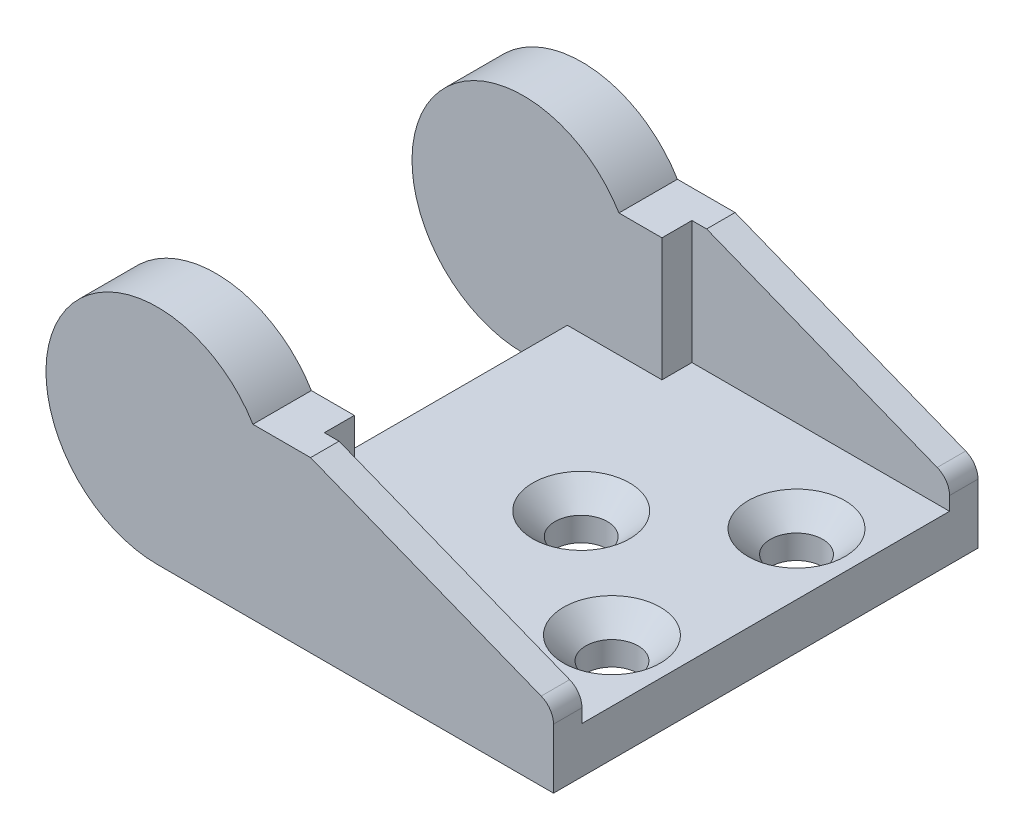
ISO-10303-21;
HEADER;
FILE_DESCRIPTION(('STEP AP214'),'2;1');
FILE_NAME('part.step','',(''),(''),'','','');
FILE_SCHEMA(('AUTOMOTIVE_DESIGN { 1 0 10303 214 1 1 1 1 }'));
ENDSEC;
DATA;
#1=APPLICATION_CONTEXT('core data for automotive mechanical design processes');
#2=APPLICATION_PROTOCOL_DEFINITION('international standard','automotive_design',2000,#1);
#3=PRODUCT_CONTEXT('',#1,'mechanical');
#4=PRODUCT('Part','Part','',(#3));
#5=PRODUCT_RELATED_PRODUCT_CATEGORY('part','',(#4));
#6=PRODUCT_DEFINITION_FORMATION('','',#4);
#7=PRODUCT_DEFINITION_CONTEXT('part definition',#1,'design');
#8=PRODUCT_DEFINITION('design','',#6,#7);
#9=PRODUCT_DEFINITION_SHAPE('','',#8);
#10=(LENGTH_UNIT() NAMED_UNIT(*) SI_UNIT(.MILLI.,.METRE.));
#11=(NAMED_UNIT(*) PLANE_ANGLE_UNIT() SI_UNIT($,.RADIAN.));
#12=(NAMED_UNIT(*) SI_UNIT($,.STERADIAN.) SOLID_ANGLE_UNIT());
#13=UNCERTAINTY_MEASURE_WITH_UNIT(LENGTH_MEASURE(1.E-05),#10,'distance_accuracy_value','');
#14=(GEOMETRIC_REPRESENTATION_CONTEXT(3) GLOBAL_UNCERTAINTY_ASSIGNED_CONTEXT((#13)) GLOBAL_UNIT_ASSIGNED_CONTEXT((#10,
#11,#12)) REPRESENTATION_CONTEXT('',''));
#15=CARTESIAN_POINT('',(0.,0.,0.));
#16=DIRECTION('',(0.,0.,1.));
#17=DIRECTION('',(1.,0.,0.));
#18=AXIS2_PLACEMENT_3D('',#15,#16,#17);
#19=CARTESIAN_POINT('',(0.,0.,13.8));
#20=DIRECTION('',(0.,0.,-1.));
#21=DIRECTION('',(-1.,0.,0.));
#22=AXIS2_PLACEMENT_3D('',#19,#20,#21);
#23=CYLINDRICAL_SURFACE('',#22,7.25);
#24=DIRECTION('',(0.,0.,-1.));
#25=VECTOR('',#24,1.);
#26=CARTESIAN_POINT('',(6.20483682299543,3.75,13.8));
#27=LINE('',#26,#25);
#28=CARTESIAN_POINT('',(6.20483682299543,3.75,13.8));
#29=VERTEX_POINT('',#28);
#30=CARTESIAN_POINT('',(6.20483682299543,3.75,10.));
#31=VERTEX_POINT('',#30);
#32=EDGE_CURVE('E236',#29,#31,#27,.T.);
#33=ORIENTED_EDGE('',*,*,#32,.T.);
#34=CARTESIAN_POINT('',(0.,0.,10.));
#35=DIRECTION('',(0.,0.,1.));
#36=DIRECTION('',(1.,0.,0.));
#37=AXIS2_PLACEMENT_3D('',#34,#35,#36);
#38=CIRCLE('',#37,7.25);
#39=CARTESIAN_POINT('',(0.,-7.25,10.));
#40=VERTEX_POINT('',#39);
#41=EDGE_CURVE('E325',#31,#40,#38,.T.);
#42=ORIENTED_EDGE('',*,*,#41,.T.);
#43=DIRECTION('',(0.,0.,-1.));
#44=VECTOR('',#43,1.);
#45=CARTESIAN_POINT('',(0.,-7.25,13.8));
#46=LINE('',#45,#44);
#47=CARTESIAN_POINT('',(0.,-7.25,13.8));
#48=VERTEX_POINT('',#47);
#49=EDGE_CURVE('E247',#48,#40,#46,.T.);
#50=ORIENTED_EDGE('',*,*,#49,.F.);
#51=CARTESIAN_POINT('',(0.,0.,13.8));
#52=DIRECTION('',(0.,0.,1.));
#53=DIRECTION('',(1.,0.,0.));
#54=AXIS2_PLACEMENT_3D('',#51,#52,#53);
#55=CIRCLE('',#54,7.25);
#56=EDGE_CURVE('E211',#29,#48,#55,.T.);
#57=ORIENTED_EDGE('',*,*,#56,.F.);
#58=EDGE_LOOP('',(#33,#42,#50,#57));
#59=FACE_BOUND('',#58,.T.);
#60=ADVANCED_FACE('F34',(#59),#23,.T.);
#61=CARTESIAN_POINT('',(0.,0.,-10.));
#62=DIRECTION('',(0.,0.,-1.));
#63=DIRECTION('',(-1.,0.,0.));
#64=AXIS2_PLACEMENT_3D('',#61,#62,#63);
#65=CIRCLE('',#64,7.25);
#66=CARTESIAN_POINT('',(0.,-7.25,-10.));
#67=VERTEX_POINT('',#66);
#68=CARTESIAN_POINT('',(6.20483682299543,3.75,-10.));
#69=VERTEX_POINT('',#68);
#70=EDGE_CURVE('E191',#67,#69,#65,.T.);
#71=ORIENTED_EDGE('',*,*,#70,.T.);
#72=CARTESIAN_POINT('',(6.20483682299543,3.75,-13.8));
#73=VERTEX_POINT('',#72);
#74=EDGE_CURVE('E224',#69,#73,#27,.T.);
#75=ORIENTED_EDGE('',*,*,#74,.T.);
#76=CARTESIAN_POINT('',(0.,0.,-13.8));
#77=DIRECTION('',(0.,0.,1.));
#78=DIRECTION('',(1.,0.,0.));
#79=AXIS2_PLACEMENT_3D('',#76,#77,#78);
#80=CIRCLE('',#79,7.25);
#81=CARTESIAN_POINT('',(0.,-7.25,-13.8));
#82=VERTEX_POINT('',#81);
#83=EDGE_CURVE('E210',#73,#82,#80,.T.);
#84=ORIENTED_EDGE('',*,*,#83,.T.);
#85=EDGE_CURVE('E246',#67,#82,#46,.T.);
#86=ORIENTED_EDGE('',*,*,#85,.F.);
#87=EDGE_LOOP('',(#71,#75,#84,#86));
#88=FACE_BOUND('',#87,.T.);
#89=ADVANCED_FACE('F335',(#88),#23,.T.);
#90=CARTESIAN_POINT('',(9.95483682299543,3.74999999999999,13.8));
#91=DIRECTION('',(0.,-1.,0.));
#92=DIRECTION('',(1.,0.,0.));
#93=AXIS2_PLACEMENT_3D('',#90,#91,#92);
#94=PLANE('',#93);
#95=DIRECTION('',(1.,0.,0.));
#96=VECTOR('',#95,1.);
#97=CARTESIAN_POINT('',(9.95483682299543,3.74999999999999,10.));
#98=LINE('',#97,#96);
#99=CARTESIAN_POINT('',(9.00000000000001,3.74999999999999,10.));
#100=VERTEX_POINT('',#99);
#101=EDGE_CURVE('E164',#31,#100,#98,.T.);
#102=ORIENTED_EDGE('',*,*,#101,.F.);
#103=ORIENTED_EDGE('',*,*,#32,.F.);
#104=DIRECTION('',(-1.,0.,0.));
#105=VECTOR('',#104,1.);
#106=CARTESIAN_POINT('',(9.95483682299543,3.74999999999999,13.8));
#107=LINE('',#106,#105);
#108=CARTESIAN_POINT('',(9.95483682299543,3.74999999999999,13.8));
#109=VERTEX_POINT('',#108);
#110=EDGE_CURVE('E222',#109,#29,#107,.T.);
#111=ORIENTED_EDGE('',*,*,#110,.F.);
#112=DIRECTION('',(0.,0.,-1.));
#113=VECTOR('',#112,1.);
#114=CARTESIAN_POINT('',(9.95483682299543,3.74999999999999,13.8));
#115=LINE('',#114,#113);
#116=CARTESIAN_POINT('',(9.95483682299543,3.74999999999999,11.95));
#117=VERTEX_POINT('',#116);
#118=EDGE_CURVE('E240',#109,#117,#115,.T.);
#119=ORIENTED_EDGE('',*,*,#118,.T.);
#120=DIRECTION('',(-1.,0.,0.));
#121=VECTOR('',#120,1.);
#122=CARTESIAN_POINT('',(9.95483682299543,3.74999999999999,11.95));
#123=LINE('',#122,#121);
#124=CARTESIAN_POINT('',(9.00000000000001,3.74999999999999,11.95));
#125=VERTEX_POINT('',#124);
#126=EDGE_CURVE('E256',#117,#125,#123,.T.);
#127=ORIENTED_EDGE('',*,*,#126,.T.);
#128=DIRECTION('',(0.,0.,-1.));
#129=VECTOR('',#128,1.);
#130=CARTESIAN_POINT('',(9.00000000000001,3.74999999999999,13.8));
#131=LINE('',#130,#129);
#132=EDGE_CURVE('E254',#125,#100,#131,.T.);
#133=ORIENTED_EDGE('',*,*,#132,.T.);
#134=EDGE_LOOP('',(#102,#103,#111,#119,#127,#133));
#135=FACE_BOUND('',#134,.T.);
#136=ADVANCED_FACE('F321',(#135),#94,.F.);
#137=DIRECTION('',(-1.,0.,0.));
#138=VECTOR('',#137,1.);
#139=CARTESIAN_POINT('',(9.95483682299543,3.74999999999999,-10.));
#140=LINE('',#139,#138);
#141=CARTESIAN_POINT('',(9.00000000000001,3.74999999999999,-10.));
#142=VERTEX_POINT('',#141);
#143=EDGE_CURVE('E168',#142,#69,#140,.T.);
#144=ORIENTED_EDGE('',*,*,#143,.F.);
#145=CARTESIAN_POINT('',(9.,3.74999999999999,-11.95));
#146=VERTEX_POINT('',#145);
#147=EDGE_CURVE('E253',#142,#146,#131,.T.);
#148=ORIENTED_EDGE('',*,*,#147,.T.);
#149=DIRECTION('',(1.,0.,0.));
#150=VECTOR('',#149,1.);
#151=CARTESIAN_POINT('',(9.95483682299543,3.74999999999999,-11.95));
#152=LINE('',#151,#150);
#153=CARTESIAN_POINT('',(9.95483682299543,3.74999999999999,-11.95));
#154=VERTEX_POINT('',#153);
#155=EDGE_CURVE('E250',#146,#154,#152,.T.);
#156=ORIENTED_EDGE('',*,*,#155,.T.);
#157=CARTESIAN_POINT('',(9.95483682299543,3.74999999999999,-13.8));
#158=VERTEX_POINT('',#157);
#159=EDGE_CURVE('E239',#154,#158,#115,.T.);
#160=ORIENTED_EDGE('',*,*,#159,.T.);
#161=DIRECTION('',(-1.,0.,0.));
#162=VECTOR('',#161,1.);
#163=CARTESIAN_POINT('',(9.95483682299543,3.74999999999999,-13.8));
#164=LINE('',#163,#162);
#165=EDGE_CURVE('E215',#158,#73,#164,.T.);
#166=ORIENTED_EDGE('',*,*,#165,.T.);
#167=ORIENTED_EDGE('',*,*,#74,.F.);
#168=EDGE_LOOP('',(#144,#148,#156,#160,#166,#167));
#169=FACE_BOUND('',#168,.T.);
#170=ADVANCED_FACE('F294',(#169),#94,.F.);
#171=CARTESIAN_POINT('',(9.,-36.4351417676872,-11.95));
#172=DIRECTION('',(-1.,0.,0.));
#173=DIRECTION('',(0.,0.,1.));
#174=AXIS2_PLACEMENT_3D('',#171,#172,#173);
#175=PLANE('',#174);
#176=DIRECTION('',(0.,-1.,0.));
#177=VECTOR('',#176,1.);
#178=CARTESIAN_POINT('',(9.00000000000001,7.25,10.));
#179=LINE('',#178,#177);
#180=CARTESIAN_POINT('',(9.00000000000001,-4.25,10.));
#181=VERTEX_POINT('',#180);
#182=EDGE_CURVE('E158',#100,#181,#179,.T.);
#183=ORIENTED_EDGE('',*,*,#182,.F.);
#184=ORIENTED_EDGE('',*,*,#132,.F.);
#185=DIRECTION('',(0.,1.,0.));
#186=VECTOR('',#185,1.);
#187=CARTESIAN_POINT('',(9.00000000000001,-36.4351417676872,11.95));
#188=LINE('',#187,#186);
#189=CARTESIAN_POINT('',(9.00000000000001,-4.25,11.95));
#190=VERTEX_POINT('',#189);
#191=EDGE_CURVE('E183',#190,#125,#188,.T.);
#192=ORIENTED_EDGE('',*,*,#191,.F.);
#193=DIRECTION('',(0.,0.,-1.));
#194=VECTOR('',#193,1.);
#195=CARTESIAN_POINT('',(9.,-4.25,-11.95));
#196=LINE('',#195,#194);
#197=EDGE_CURVE('E175',#190,#181,#196,.T.);
#198=ORIENTED_EDGE('',*,*,#197,.T.);
#199=EDGE_LOOP('',(#183,#184,#192,#198));
#200=FACE_BOUND('',#199,.T.);
#201=ADVANCED_FACE('F181',(#200),#175,.F.);
#202=DIRECTION('',(0.,-1.,0.));
#203=VECTOR('',#202,1.);
#204=CARTESIAN_POINT('',(9.00000000000001,7.25,-10.));
#205=LINE('',#204,#203);
#206=CARTESIAN_POINT('',(9.00000000000001,-4.25,-10.));
#207=VERTEX_POINT('',#206);
#208=EDGE_CURVE('E169',#142,#207,#205,.T.);
#209=ORIENTED_EDGE('',*,*,#208,.T.);
#210=CARTESIAN_POINT('',(9.,-4.25,-11.95));
#211=VERTEX_POINT('',#210);
#212=EDGE_CURVE('E185',#207,#211,#196,.T.);
#213=ORIENTED_EDGE('',*,*,#212,.T.);
#214=DIRECTION('',(0.,1.,0.));
#215=VECTOR('',#214,1.);
#216=CARTESIAN_POINT('',(9.,-36.4351417676872,-11.95));
#217=LINE('',#216,#215);
#218=EDGE_CURVE('E200',#211,#146,#217,.T.);
#219=ORIENTED_EDGE('',*,*,#218,.T.);
#220=ORIENTED_EDGE('',*,*,#147,.F.);
#221=EDGE_LOOP('',(#209,#213,#219,#220));
#222=FACE_BOUND('',#221,.T.);
#223=ADVANCED_FACE('F300',(#222),#175,.F.);
#224=CARTESIAN_POINT('',(2.85,7.25,-10.));
#225=DIRECTION('',(1.,0.,0.));
#226=DIRECTION('',(0.,0.,-1.));
#227=AXIS2_PLACEMENT_3D('',#224,#225,#226);
#228=PLANE('',#227);
#229=DIRECTION('',(0.,0.,1.));
#230=VECTOR('',#229,1.);
#231=CARTESIAN_POINT('',(2.85,-4.25,-10.));
#232=LINE('',#231,#230);
#233=CARTESIAN_POINT('',(2.85,-4.25,-10.));
#234=VERTEX_POINT('',#233);
#235=CARTESIAN_POINT('',(2.85,-4.25,10.));
#236=VERTEX_POINT('',#235);
#237=EDGE_CURVE('E178',#234,#236,#232,.T.);
#238=ORIENTED_EDGE('',*,*,#237,.F.);
#239=DIRECTION('',(0.,-1.,0.));
#240=VECTOR('',#239,1.);
#241=CARTESIAN_POINT('',(2.85,7.25,-10.));
#242=LINE('',#241,#240);
#243=CARTESIAN_POINT('',(2.85,-7.25,-10.));
#244=VERTEX_POINT('',#243);
#245=EDGE_CURVE('E348',#234,#244,#242,.T.);
#246=ORIENTED_EDGE('',*,*,#245,.T.);
#247=DIRECTION('',(0.,0.,1.));
#248=VECTOR('',#247,1.);
#249=CARTESIAN_POINT('',(2.85,-7.25,-10.));
#250=LINE('',#249,#248);
#251=CARTESIAN_POINT('',(2.85,-7.25,10.));
#252=VERTEX_POINT('',#251);
#253=EDGE_CURVE('E340',#244,#252,#250,.T.);
#254=ORIENTED_EDGE('',*,*,#253,.T.);
#255=DIRECTION('',(0.,-1.,0.));
#256=VECTOR('',#255,1.);
#257=CARTESIAN_POINT('',(2.85,7.25,10.));
#258=LINE('',#257,#256);
#259=EDGE_CURVE('E347',#236,#252,#258,.T.);
#260=ORIENTED_EDGE('',*,*,#259,.F.);
#261=EDGE_LOOP('',(#238,#246,#254,#260));
#262=FACE_BOUND('',#261,.T.);
#263=ADVANCED_FACE('F351',(#262),#228,.F.);
#264=CARTESIAN_POINT('',(25.75,-2.5,13.8));
#265=DIRECTION('',(-0.367933828085746,-0.92985197647269,0.));
#266=DIRECTION('',(0.92985197647269,-0.367933828085746,0.));
#267=AXIS2_PLACEMENT_3D('',#264,#265,#266);
#268=PLANE('',#267);
#269=DIRECTION('',(-0.92985197647269,0.367933828085746,0.));
#270=VECTOR('',#269,1.);
#271=CARTESIAN_POINT('',(25.75,-2.5,13.8));
#272=LINE('',#271,#270);
#273=CARTESIAN_POINT('',(24.9472759616689,-2.18236952139416,13.8));
#274=VERTEX_POINT('',#273);
#275=EDGE_CURVE('E220',#274,#109,#272,.T.);
#276=ORIENTED_EDGE('',*,*,#275,.F.);
#277=DIRECTION('',(0.,0.,-1.));
#278=VECTOR('',#277,1.);
#279=CARTESIAN_POINT('',(24.9472759616689,-2.18236952139416,13.8));
#280=LINE('',#279,#278);
#281=CARTESIAN_POINT('',(24.9472759616689,-2.18236952139416,11.95));
#282=VERTEX_POINT('',#281);
#283=EDGE_CURVE('E262',#274,#282,#280,.T.);
#284=ORIENTED_EDGE('',*,*,#283,.T.);
#285=DIRECTION('',(-0.92985197647269,0.367933828085746,0.));
#286=VECTOR('',#285,1.);
#287=CARTESIAN_POINT('',(25.75,-2.5,11.95));
#288=LINE('',#287,#286);
#289=EDGE_CURVE('E208',#282,#117,#288,.T.);
#290=ORIENTED_EDGE('',*,*,#289,.T.);
#291=ORIENTED_EDGE('',*,*,#118,.F.);
#292=EDGE_LOOP('',(#276,#284,#290,#291));
#293=FACE_BOUND('',#292,.T.);
#294=ADVANCED_FACE('F315',(#293),#268,.F.);
#295=CARTESIAN_POINT('',(0.,-7.25,13.8));
#296=DIRECTION('',(0.,1.,0.));
#297=DIRECTION('',(0.,0.,1.));
#298=AXIS2_PLACEMENT_3D('',#295,#296,#297);
#299=PLANE('',#298);
#300=CARTESIAN_POINT('',(21.75,-7.25,-6.));
#301=DIRECTION('',(0.,1.,0.));
#302=DIRECTION('',(0.,0.,1.));
#303=AXIS2_PLACEMENT_3D('',#300,#301,#302);
#304=CIRCLE('',#303,1.7);
#305=CARTESIAN_POINT('',(21.75,-7.25,-4.3));
#306=VERTEX_POINT('',#305);
#307=EDGE_CURVE('E374',#306,#306,#304,.T.);
#308=ORIENTED_EDGE('',*,*,#307,.T.);
#309=EDGE_LOOP('',(#308));
#310=FACE_BOUND('',#309,.T.);
#311=CARTESIAN_POINT('',(13.75,-7.25,0.));
#312=DIRECTION('',(0.,1.,0.));
#313=DIRECTION('',(0.,0.,1.));
#314=AXIS2_PLACEMENT_3D('',#311,#312,#313);
#315=CIRCLE('',#314,1.7);
#316=CARTESIAN_POINT('',(13.75,-7.25,1.7));
#317=VERTEX_POINT('',#316);
#318=EDGE_CURVE('E365',#317,#317,#315,.T.);
#319=ORIENTED_EDGE('',*,*,#318,.T.);
#320=EDGE_LOOP('',(#319));
#321=FACE_BOUND('',#320,.T.);
#322=CARTESIAN_POINT('',(21.75,-7.25,6.));
#323=DIRECTION('',(0.,1.,0.));
#324=DIRECTION('',(0.,0.,1.));
#325=AXIS2_PLACEMENT_3D('',#322,#323,#324);
#326=CIRCLE('',#325,1.7);
#327=CARTESIAN_POINT('',(21.75,-7.25,7.7));
#328=VERTEX_POINT('',#327);
#329=EDGE_CURVE('E356',#328,#328,#326,.T.);
#330=ORIENTED_EDGE('',*,*,#329,.T.);
#331=EDGE_LOOP('',(#330));
#332=FACE_BOUND('',#331,.T.);
#333=ORIENTED_EDGE('',*,*,#253,.F.);
#334=DIRECTION('',(-1.,0.,0.));
#335=VECTOR('',#334,1.);
#336=CARTESIAN_POINT('',(0.,-7.25,-10.));
#337=LINE('',#336,#335);
#338=EDGE_CURVE('E259',#244,#67,#337,.T.);
#339=ORIENTED_EDGE('',*,*,#338,.T.);
#340=ORIENTED_EDGE('',*,*,#85,.T.);
#341=DIRECTION('',(1.,0.,0.));
#342=VECTOR('',#341,1.);
#343=CARTESIAN_POINT('',(0.,-7.25,-13.8));
#344=LINE('',#343,#342);
#345=CARTESIAN_POINT('',(25.75,-7.25,-13.8));
#346=VERTEX_POINT('',#345);
#347=EDGE_CURVE('E227',#82,#346,#344,.T.);
#348=ORIENTED_EDGE('',*,*,#347,.T.);
#349=DIRECTION('',(0.,0.,-1.));
#350=VECTOR('',#349,1.);
#351=CARTESIAN_POINT('',(25.75,-7.25,13.8));
#352=LINE('',#351,#350);
#353=CARTESIAN_POINT('',(25.75,-7.25,13.8));
#354=VERTEX_POINT('',#353);
#355=EDGE_CURVE('E243',#354,#346,#352,.T.);
#356=ORIENTED_EDGE('',*,*,#355,.F.);
#357=DIRECTION('',(1.,0.,0.));
#358=VECTOR('',#357,1.);
#359=CARTESIAN_POINT('',(0.,-7.25,13.8));
#360=LINE('',#359,#358);
#361=EDGE_CURVE('E214',#48,#354,#360,.T.);
#362=ORIENTED_EDGE('',*,*,#361,.F.);
#363=ORIENTED_EDGE('',*,*,#49,.T.);
#364=DIRECTION('',(-1.,0.,0.));
#365=VECTOR('',#364,1.);
#366=CARTESIAN_POINT('',(2.85,-7.25,10.));
#367=LINE('',#366,#365);
#368=EDGE_CURVE('E331',#252,#40,#367,.T.);
#369=ORIENTED_EDGE('',*,*,#368,.F.);
#370=EDGE_LOOP('',(#333,#339,#340,#348,#356,#362,#363,#369));
#371=FACE_BOUND('',#370,.T.);
#372=ADVANCED_FACE('F330',(#310,#321,#332,#371),#299,.F.);
#373=CARTESIAN_POINT('',(25.75,-7.25,13.8));
#374=DIRECTION('',(-1.,0.,0.));
#375=DIRECTION('',(0.,0.,1.));
#376=AXIS2_PLACEMENT_3D('',#373,#374,#375);
#377=PLANE('',#376);
#378=DIRECTION('',(0.,1.,0.));
#379=VECTOR('',#378,1.);
#380=CARTESIAN_POINT('',(25.75,-36.4351417676872,11.95));
#381=LINE('',#380,#379);
#382=CARTESIAN_POINT('',(25.75,-4.25,11.95));
#383=VERTEX_POINT('',#382);
#384=CARTESIAN_POINT('',(25.75,-3.36328153151447,11.95));
#385=VERTEX_POINT('',#384);
#386=EDGE_CURVE('E189',#383,#385,#381,.T.);
#387=ORIENTED_EDGE('',*,*,#386,.T.);
#388=DIRECTION('',(0.,0.,-1.));
#389=VECTOR('',#388,1.);
#390=CARTESIAN_POINT('',(25.75,-3.36328153151447,13.8));
#391=LINE('',#390,#389);
#392=CARTESIAN_POINT('',(25.75,-3.36328153151447,13.8));
#393=VERTEX_POINT('',#392);
#394=EDGE_CURVE('E269',#385,#393,#391,.F.);
#395=ORIENTED_EDGE('',*,*,#394,.T.);
#396=DIRECTION('',(0.,1.,0.));
#397=VECTOR('',#396,1.);
#398=CARTESIAN_POINT('',(25.75,-7.25,13.8));
#399=LINE('',#398,#397);
#400=EDGE_CURVE('E217',#354,#393,#399,.T.);
#401=ORIENTED_EDGE('',*,*,#400,.F.);
#402=ORIENTED_EDGE('',*,*,#355,.T.);
#403=DIRECTION('',(0.,1.,0.));
#404=VECTOR('',#403,1.);
#405=CARTESIAN_POINT('',(25.75,-7.25,-13.8));
#406=LINE('',#405,#404);
#407=CARTESIAN_POINT('',(25.75,-3.36328153151447,-13.8));
#408=VERTEX_POINT('',#407);
#409=EDGE_CURVE('E229',#346,#408,#406,.T.);
#410=ORIENTED_EDGE('',*,*,#409,.T.);
#411=DIRECTION('',(0.,0.,-1.));
#412=VECTOR('',#411,1.);
#413=CARTESIAN_POINT('',(25.75,-3.36328153151447,13.8));
#414=LINE('',#413,#412);
#415=CARTESIAN_POINT('',(25.75,-3.36328153151447,-11.95));
#416=VERTEX_POINT('',#415);
#417=EDGE_CURVE('E267',#408,#416,#414,.F.);
#418=ORIENTED_EDGE('',*,*,#417,.T.);
#419=DIRECTION('',(0.,1.,0.));
#420=VECTOR('',#419,1.);
#421=CARTESIAN_POINT('',(25.75,-36.4351417676872,-11.95));
#422=LINE('',#421,#420);
#423=CARTESIAN_POINT('',(25.75,-4.25,-11.95));
#424=VERTEX_POINT('',#423);
#425=EDGE_CURVE('E203',#424,#416,#422,.T.);
#426=ORIENTED_EDGE('',*,*,#425,.F.);
#427=DIRECTION('',(0.,0.,1.));
#428=VECTOR('',#427,1.);
#429=CARTESIAN_POINT('',(25.75,-4.25,-11.95));
#430=LINE('',#429,#428);
#431=EDGE_CURVE('E187',#424,#383,#430,.T.);
#432=ORIENTED_EDGE('',*,*,#431,.T.);
#433=EDGE_LOOP('',(#387,#395,#401,#402,#410,#418,#426,#432));
#434=FACE_BOUND('',#433,.T.);
#435=ADVANCED_FACE('F281',(#434),#377,.F.);
#436=DIRECTION('',(0.92985197647269,-0.367933828085746,0.));
#437=VECTOR('',#436,1.);
#438=CARTESIAN_POINT('',(25.75,-2.5,-11.95));
#439=LINE('',#438,#437);
#440=CARTESIAN_POINT('',(24.9472759616689,-2.18236952139416,-11.95));
#441=VERTEX_POINT('',#440);
#442=EDGE_CURVE('E206',#154,#441,#439,.T.);
#443=ORIENTED_EDGE('',*,*,#442,.T.);
#444=DIRECTION('',(0.,0.,-1.));
#445=VECTOR('',#444,1.);
#446=CARTESIAN_POINT('',(24.9472759616689,-2.18236952139416,13.8));
#447=LINE('',#446,#445);
#448=CARTESIAN_POINT('',(24.9472759616689,-2.18236952139416,-13.8));
#449=VERTEX_POINT('',#448);
#450=EDGE_CURVE('E273',#441,#449,#447,.T.);
#451=ORIENTED_EDGE('',*,*,#450,.T.);
#452=DIRECTION('',(-0.92985197647269,0.367933828085746,0.));
#453=VECTOR('',#452,1.);
#454=CARTESIAN_POINT('',(25.75,-2.5,-13.8));
#455=LINE('',#454,#453);
#456=EDGE_CURVE('E232',#449,#158,#455,.T.);
#457=ORIENTED_EDGE('',*,*,#456,.T.);
#458=ORIENTED_EDGE('',*,*,#159,.F.);
#459=EDGE_LOOP('',(#443,#451,#457,#458));
#460=FACE_BOUND('',#459,.T.);
#461=ADVANCED_FACE('F286',(#460),#268,.F.);
#462=CARTESIAN_POINT('',(0.,0.,13.8));
#463=DIRECTION('',(0.,0.,1.));
#464=DIRECTION('',(1.,0.,0.));
#465=AXIS2_PLACEMENT_3D('',#462,#463,#464);
#466=PLANE('',#465);
#467=ORIENTED_EDGE('',*,*,#400,.T.);
#468=CARTESIAN_POINT('',(24.48,-3.36328153151447,13.8));
#469=DIRECTION('',(0.,0.,1.));
#470=DIRECTION('',(1.,0.,0.));
#471=AXIS2_PLACEMENT_3D('',#468,#469,#470);
#472=CIRCLE('',#471,1.27);
#473=EDGE_CURVE('E271',#393,#274,#472,.T.);
#474=ORIENTED_EDGE('',*,*,#473,.T.);
#475=ORIENTED_EDGE('',*,*,#275,.T.);
#476=ORIENTED_EDGE('',*,*,#110,.T.);
#477=ORIENTED_EDGE('',*,*,#56,.T.);
#478=ORIENTED_EDGE('',*,*,#361,.T.);
#479=EDGE_LOOP('',(#467,#474,#475,#476,#477,#478));
#480=FACE_BOUND('',#479,.T.);
#481=ADVANCED_FACE('F312',(#480),#466,.T.);
#482=CARTESIAN_POINT('',(0.,0.,-13.8));
#483=DIRECTION('',(0.,0.,1.));
#484=DIRECTION('',(1.,0.,0.));
#485=AXIS2_PLACEMENT_3D('',#482,#483,#484);
#486=PLANE('',#485);
#487=ORIENTED_EDGE('',*,*,#456,.F.);
#488=CARTESIAN_POINT('',(24.48,-3.36328153151447,-13.8));
#489=DIRECTION('',(0.,0.,1.));
#490=DIRECTION('',(1.,0.,0.));
#491=AXIS2_PLACEMENT_3D('',#488,#489,#490);
#492=CIRCLE('',#491,1.27);
#493=EDGE_CURVE('E42',#449,#408,#492,.F.);
#494=ORIENTED_EDGE('',*,*,#493,.T.);
#495=ORIENTED_EDGE('',*,*,#409,.F.);
#496=ORIENTED_EDGE('',*,*,#347,.F.);
#497=ORIENTED_EDGE('',*,*,#83,.F.);
#498=ORIENTED_EDGE('',*,*,#165,.F.);
#499=EDGE_LOOP('',(#487,#494,#495,#496,#497,#498));
#500=FACE_BOUND('',#499,.T.);
#501=ADVANCED_FACE('F277',(#500),#486,.F.);
#502=CARTESIAN_POINT('',(25.75,-36.4351417676872,11.95));
#503=DIRECTION('',(0.,0.,1.));
#504=DIRECTION('',(1.,0.,0.));
#505=AXIS2_PLACEMENT_3D('',#502,#503,#504);
#506=PLANE('',#505);
#507=ORIENTED_EDGE('',*,*,#289,.F.);
#508=CARTESIAN_POINT('',(24.48,-3.36328153151447,11.95));
#509=DIRECTION('',(0.,0.,1.));
#510=DIRECTION('',(1.,0.,0.));
#511=AXIS2_PLACEMENT_3D('',#508,#509,#510);
#512=CIRCLE('',#511,1.27);
#513=EDGE_CURVE('E265',#282,#385,#512,.F.);
#514=ORIENTED_EDGE('',*,*,#513,.T.);
#515=ORIENTED_EDGE('',*,*,#386,.F.);
#516=DIRECTION('',(-1.,0.,0.));
#517=VECTOR('',#516,1.);
#518=CARTESIAN_POINT('',(25.75,-4.25,11.95));
#519=LINE('',#518,#517);
#520=EDGE_CURVE('E184',#383,#190,#519,.T.);
#521=ORIENTED_EDGE('',*,*,#520,.T.);
#522=ORIENTED_EDGE('',*,*,#191,.T.);
#523=ORIENTED_EDGE('',*,*,#126,.F.);
#524=EDGE_LOOP('',(#507,#514,#515,#521,#522,#523));
#525=FACE_BOUND('',#524,.T.);
#526=ADVANCED_FACE('F429',(#525),#506,.F.);
#527=CARTESIAN_POINT('',(25.75,-36.4351417676872,-11.95));
#528=DIRECTION('',(0.,0.,-1.));
#529=DIRECTION('',(-1.,0.,0.));
#530=AXIS2_PLACEMENT_3D('',#527,#528,#529);
#531=PLANE('',#530);
#532=ORIENTED_EDGE('',*,*,#425,.T.);
#533=CARTESIAN_POINT('',(24.48,-3.36328153151447,-11.95));
#534=DIRECTION('',(0.,0.,-1.));
#535=DIRECTION('',(-1.,0.,0.));
#536=AXIS2_PLACEMENT_3D('',#533,#534,#535);
#537=CIRCLE('',#536,1.27);
#538=EDGE_CURVE('E12',#416,#441,#537,.F.);
#539=ORIENTED_EDGE('',*,*,#538,.T.);
#540=ORIENTED_EDGE('',*,*,#442,.F.);
#541=ORIENTED_EDGE('',*,*,#155,.F.);
#542=ORIENTED_EDGE('',*,*,#218,.F.);
#543=DIRECTION('',(1.,0.,0.));
#544=VECTOR('',#543,1.);
#545=CARTESIAN_POINT('',(25.75,-4.25,-11.95));
#546=LINE('',#545,#544);
#547=EDGE_CURVE('E196',#211,#424,#546,.T.);
#548=ORIENTED_EDGE('',*,*,#547,.T.);
#549=EDGE_LOOP('',(#532,#539,#540,#541,#542,#548));
#550=FACE_BOUND('',#549,.T.);
#551=ADVANCED_FACE('F290',(#550),#531,.F.);
#552=CARTESIAN_POINT('',(0.,-4.25,13.8));
#553=DIRECTION('',(0.,1.,0.));
#554=DIRECTION('',(0.,0.,1.));
#555=AXIS2_PLACEMENT_3D('',#552,#553,#554);
#556=PLANE('',#555);
#557=CARTESIAN_POINT('',(21.75,-4.25,-6.));
#558=DIRECTION('',(0.,1.,0.));
#559=DIRECTION('',(0.,0.,1.));
#560=AXIS2_PLACEMENT_3D('',#557,#558,#559);
#561=CIRCLE('',#560,3.15);
#562=CARTESIAN_POINT('',(21.75,-4.25,-2.85));
#563=VERTEX_POINT('',#562);
#564=EDGE_CURVE('E380',#563,#563,#561,.T.);
#565=ORIENTED_EDGE('',*,*,#564,.F.);
#566=EDGE_LOOP('',(#565));
#567=FACE_BOUND('',#566,.T.);
#568=CARTESIAN_POINT('',(13.75,-4.25,0.));
#569=DIRECTION('',(0.,1.,0.));
#570=DIRECTION('',(0.,0.,1.));
#571=AXIS2_PLACEMENT_3D('',#568,#569,#570);
#572=CIRCLE('',#571,3.15);
#573=CARTESIAN_POINT('',(13.75,-4.25,3.15));
#574=VERTEX_POINT('',#573);
#575=EDGE_CURVE('E371',#574,#574,#572,.T.);
#576=ORIENTED_EDGE('',*,*,#575,.F.);
#577=EDGE_LOOP('',(#576));
#578=FACE_BOUND('',#577,.T.);
#579=CARTESIAN_POINT('',(21.75,-4.25,6.));
#580=DIRECTION('',(0.,1.,0.));
#581=DIRECTION('',(0.,0.,1.));
#582=AXIS2_PLACEMENT_3D('',#579,#580,#581);
#583=CIRCLE('',#582,3.15);
#584=CARTESIAN_POINT('',(21.75,-4.25,9.15));
#585=VERTEX_POINT('',#584);
#586=EDGE_CURVE('E362',#585,#585,#583,.T.);
#587=ORIENTED_EDGE('',*,*,#586,.F.);
#588=EDGE_LOOP('',(#587));
#589=FACE_BOUND('',#588,.T.);
#590=ORIENTED_EDGE('',*,*,#431,.F.);
#591=ORIENTED_EDGE('',*,*,#547,.F.);
#592=ORIENTED_EDGE('',*,*,#212,.F.);
#593=DIRECTION('',(-1.,0.,0.));
#594=VECTOR('',#593,1.);
#595=CARTESIAN_POINT('',(2.85,-4.25,-10.));
#596=LINE('',#595,#594);
#597=EDGE_CURVE('E179',#207,#234,#596,.T.);
#598=ORIENTED_EDGE('',*,*,#597,.T.);
#599=ORIENTED_EDGE('',*,*,#237,.T.);
#600=DIRECTION('',(1.,0.,0.));
#601=VECTOR('',#600,1.);
#602=CARTESIAN_POINT('',(2.85,-4.25,10.));
#603=LINE('',#602,#601);
#604=EDGE_CURVE('E161',#236,#181,#603,.T.);
#605=ORIENTED_EDGE('',*,*,#604,.T.);
#606=ORIENTED_EDGE('',*,*,#197,.F.);
#607=ORIENTED_EDGE('',*,*,#520,.F.);
#608=EDGE_LOOP('',(#590,#591,#592,#598,#599,#605,#606,#607));
#609=FACE_BOUND('',#608,.T.);
#610=ADVANCED_FACE('F174',(#567,#578,#589,#609),#556,.T.);
#611=CARTESIAN_POINT('',(2.85,7.25,-10.));
#612=DIRECTION('',(0.,0.,-1.));
#613=DIRECTION('',(-1.,0.,0.));
#614=AXIS2_PLACEMENT_3D('',#611,#612,#613);
#615=PLANE('',#614);
#616=ORIENTED_EDGE('',*,*,#70,.F.);
#617=ORIENTED_EDGE('',*,*,#338,.F.);
#618=ORIENTED_EDGE('',*,*,#245,.F.);
#619=ORIENTED_EDGE('',*,*,#597,.F.);
#620=ORIENTED_EDGE('',*,*,#208,.F.);
#621=ORIENTED_EDGE('',*,*,#143,.T.);
#622=EDGE_LOOP('',(#616,#617,#618,#619,#620,#621));
#623=FACE_BOUND('',#622,.T.);
#624=ADVANCED_FACE('F338',(#623),#615,.F.);
#625=CARTESIAN_POINT('',(2.85,7.25,10.));
#626=DIRECTION('',(0.,0.,1.));
#627=DIRECTION('',(1.,0.,0.));
#628=AXIS2_PLACEMENT_3D('',#625,#626,#627);
#629=PLANE('',#628);
#630=ORIENTED_EDGE('',*,*,#41,.F.);
#631=ORIENTED_EDGE('',*,*,#101,.T.);
#632=ORIENTED_EDGE('',*,*,#182,.T.);
#633=ORIENTED_EDGE('',*,*,#604,.F.);
#634=ORIENTED_EDGE('',*,*,#259,.T.);
#635=ORIENTED_EDGE('',*,*,#368,.T.);
#636=EDGE_LOOP('',(#630,#631,#632,#633,#634,#635));
#637=FACE_BOUND('',#636,.T.);
#638=ADVANCED_FACE('F160',(#637),#629,.F.);
#639=CARTESIAN_POINT('',(24.48,-3.36328153151447,13.8));
#640=DIRECTION('',(0.,0.,-1.));
#641=DIRECTION('',(-1.,0.,0.));
#642=AXIS2_PLACEMENT_3D('',#639,#640,#641);
#643=CYLINDRICAL_SURFACE('',#642,1.27);
#644=ORIENTED_EDGE('',*,*,#473,.F.);
#645=ORIENTED_EDGE('',*,*,#394,.F.);
#646=ORIENTED_EDGE('',*,*,#513,.F.);
#647=ORIENTED_EDGE('',*,*,#283,.F.);
#648=EDGE_LOOP('',(#644,#645,#646,#647));
#649=FACE_BOUND('',#648,.T.);
#650=ADVANCED_FACE('F308',(#649),#643,.T.);
#651=CARTESIAN_POINT('',(24.48,-3.36328153151447,13.8));
#652=DIRECTION('',(0.,0.,-1.));
#653=DIRECTION('',(-1.,0.,0.));
#654=AXIS2_PLACEMENT_3D('',#651,#652,#653);
#655=CYLINDRICAL_SURFACE('',#654,1.27);
#656=ORIENTED_EDGE('',*,*,#538,.F.);
#657=ORIENTED_EDGE('',*,*,#417,.F.);
#658=ORIENTED_EDGE('',*,*,#493,.F.);
#659=ORIENTED_EDGE('',*,*,#450,.F.);
#660=EDGE_LOOP('',(#656,#657,#658,#659));
#661=FACE_BOUND('',#660,.T.);
#662=ADVANCED_FACE('F36',(#661),#655,.T.);
#663=CARTESIAN_POINT('',(21.75,-4.25,6.));
#664=DIRECTION('',(0.,1.,0.));
#665=DIRECTION('',(0.,0.,1.));
#666=AXIS2_PLACEMENT_3D('',#663,#664,#665);
#667=CYLINDRICAL_SURFACE('',#666,1.7);
#668=ORIENTED_EDGE('',*,*,#329,.F.);
#669=EDGE_LOOP('',(#668));
#670=FACE_BOUND('',#669,.T.);
#671=CARTESIAN_POINT('',(21.75,-5.7,6.));
#672=DIRECTION('',(0.,1.,0.));
#673=DIRECTION('',(0.,0.,1.));
#674=AXIS2_PLACEMENT_3D('',#671,#672,#673);
#675=CIRCLE('',#674,1.7);
#676=CARTESIAN_POINT('',(21.75,-5.7,7.7));
#677=VERTEX_POINT('',#676);
#678=EDGE_CURVE('E359',#677,#677,#675,.T.);
#679=ORIENTED_EDGE('',*,*,#678,.T.);
#680=EDGE_LOOP('',(#679));
#681=FACE_BOUND('',#680,.T.);
#682=ADVANCED_FACE('F396',(#670,#681),#667,.F.);
#683=CARTESIAN_POINT('',(21.75,-4.25,6.));
#684=DIRECTION('',(0.,1.,0.));
#685=DIRECTION('',(0.,0.,1.));
#686=AXIS2_PLACEMENT_3D('',#683,#684,#685);
#687=CONICAL_SURFACE('',#686,3.15,0.785398163397448);
#688=ORIENTED_EDGE('',*,*,#678,.F.);
#689=EDGE_LOOP('',(#688));
#690=FACE_BOUND('',#689,.T.);
#691=ORIENTED_EDGE('',*,*,#586,.T.);
#692=EDGE_LOOP('',(#691));
#693=FACE_BOUND('',#692,.T.);
#694=ADVANCED_FACE('F393',(#690,#693),#687,.F.);
#695=CARTESIAN_POINT('',(13.75,-4.25,0.));
#696=DIRECTION('',(0.,1.,0.));
#697=DIRECTION('',(0.,0.,1.));
#698=AXIS2_PLACEMENT_3D('',#695,#696,#697);
#699=CYLINDRICAL_SURFACE('',#698,1.7);
#700=ORIENTED_EDGE('',*,*,#318,.F.);
#701=EDGE_LOOP('',(#700));
#702=FACE_BOUND('',#701,.T.);
#703=CARTESIAN_POINT('',(13.75,-5.7,0.));
#704=DIRECTION('',(0.,1.,0.));
#705=DIRECTION('',(0.,0.,1.));
#706=AXIS2_PLACEMENT_3D('',#703,#704,#705);
#707=CIRCLE('',#706,1.7);
#708=CARTESIAN_POINT('',(13.75,-5.7,1.7));
#709=VERTEX_POINT('',#708);
#710=EDGE_CURVE('E368',#709,#709,#707,.T.);
#711=ORIENTED_EDGE('',*,*,#710,.T.);
#712=EDGE_LOOP('',(#711));
#713=FACE_BOUND('',#712,.T.);
#714=ADVANCED_FACE('F395',(#702,#713),#699,.F.);
#715=CARTESIAN_POINT('',(13.75,-4.25,0.));
#716=DIRECTION('',(0.,1.,0.));
#717=DIRECTION('',(0.,0.,1.));
#718=AXIS2_PLACEMENT_3D('',#715,#716,#717);
#719=CONICAL_SURFACE('',#718,3.15,0.785398163397448);
#720=ORIENTED_EDGE('',*,*,#710,.F.);
#721=EDGE_LOOP('',(#720));
#722=FACE_BOUND('',#721,.T.);
#723=ORIENTED_EDGE('',*,*,#575,.T.);
#724=EDGE_LOOP('',(#723));
#725=FACE_BOUND('',#724,.T.);
#726=ADVANCED_FACE('F403',(#722,#725),#719,.F.);
#727=CARTESIAN_POINT('',(21.75,-4.25,-6.));
#728=DIRECTION('',(0.,1.,0.));
#729=DIRECTION('',(0.,0.,1.));
#730=AXIS2_PLACEMENT_3D('',#727,#728,#729);
#731=CYLINDRICAL_SURFACE('',#730,1.7);
#732=ORIENTED_EDGE('',*,*,#307,.F.);
#733=EDGE_LOOP('',(#732));
#734=FACE_BOUND('',#733,.T.);
#735=CARTESIAN_POINT('',(21.75,-5.7,-6.));
#736=DIRECTION('',(0.,1.,0.));
#737=DIRECTION('',(0.,0.,1.));
#738=AXIS2_PLACEMENT_3D('',#735,#736,#737);
#739=CIRCLE('',#738,1.7);
#740=CARTESIAN_POINT('',(21.75,-5.7,-4.3));
#741=VERTEX_POINT('',#740);
#742=EDGE_CURVE('E377',#741,#741,#739,.T.);
#743=ORIENTED_EDGE('',*,*,#742,.T.);
#744=EDGE_LOOP('',(#743));
#745=FACE_BOUND('',#744,.T.);
#746=ADVANCED_FACE('F462',(#734,#745),#731,.F.);
#747=CARTESIAN_POINT('',(21.75,-4.25,-6.));
#748=DIRECTION('',(0.,1.,0.));
#749=DIRECTION('',(0.,0.,1.));
#750=AXIS2_PLACEMENT_3D('',#747,#748,#749);
#751=CONICAL_SURFACE('',#750,3.15,0.785398163397448);
#752=ORIENTED_EDGE('',*,*,#742,.F.);
#753=EDGE_LOOP('',(#752));
#754=FACE_BOUND('',#753,.T.);
#755=ORIENTED_EDGE('',*,*,#564,.T.);
#756=EDGE_LOOP('',(#755));
#757=FACE_BOUND('',#756,.T.);
#758=ADVANCED_FACE('F384',(#754,#757),#751,.F.);
#759=CLOSED_SHELL('',(#60,#89,#136,#170,#201,#223,#263,#294,#372,#435,#461,#481,#501,#526,#551,
#610,#624,#638,#650,#662,#682,#694,#714,#726,#746,#758));
#760=MANIFOLD_SOLID_BREP('B2',#759);
#761=ADVANCED_BREP_SHAPE_REPRESENTATION('',(#18,#760),#14);
#762=SHAPE_DEFINITION_REPRESENTATION(#9,#761);
ENDSEC;
END-ISO-10303-21;
